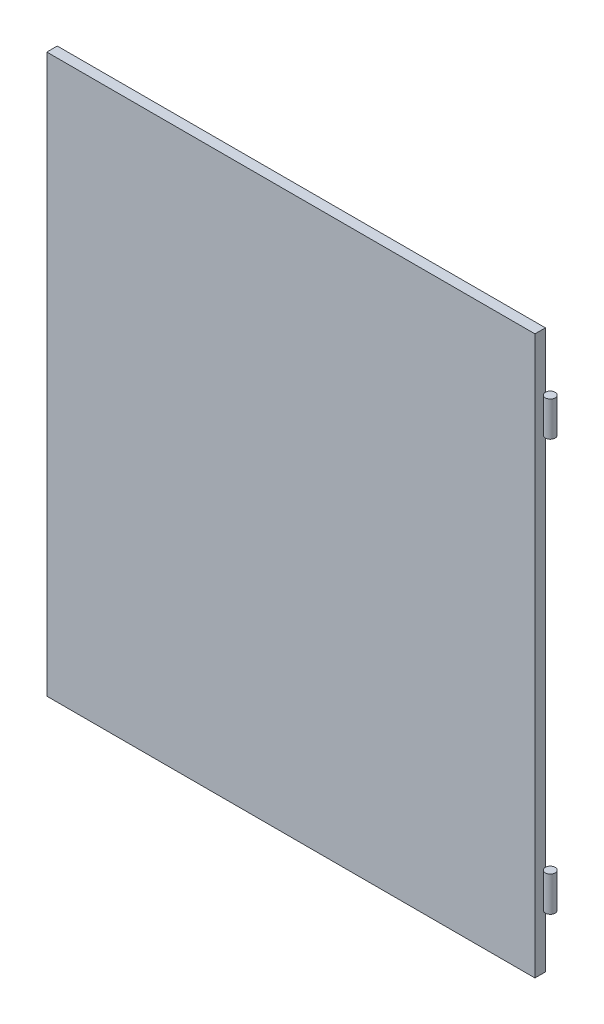
ISO-10303-21;
HEADER;
FILE_DESCRIPTION(('STEP AP214'),'2;1');
FILE_NAME('part.step','',(''),(''),'','','');
FILE_SCHEMA(('AUTOMOTIVE_DESIGN { 1 0 10303 214 1 1 1 1 }'));
ENDSEC;
DATA;
#1=APPLICATION_CONTEXT('core data for automotive mechanical design processes');
#2=APPLICATION_PROTOCOL_DEFINITION('international standard','automotive_design',2000,#1);
#3=PRODUCT_CONTEXT('',#1,'mechanical');
#4=PRODUCT('Part','Part','',(#3));
#5=PRODUCT_RELATED_PRODUCT_CATEGORY('part','',(#4));
#6=PRODUCT_DEFINITION_FORMATION('','',#4);
#7=PRODUCT_DEFINITION_CONTEXT('part definition',#1,'design');
#8=PRODUCT_DEFINITION('design','',#6,#7);
#9=PRODUCT_DEFINITION_SHAPE('','',#8);
#10=(LENGTH_UNIT() NAMED_UNIT(*) SI_UNIT(.MILLI.,.METRE.));
#11=(NAMED_UNIT(*) PLANE_ANGLE_UNIT() SI_UNIT($,.RADIAN.));
#12=(NAMED_UNIT(*) SI_UNIT($,.STERADIAN.) SOLID_ANGLE_UNIT());
#13=UNCERTAINTY_MEASURE_WITH_UNIT(LENGTH_MEASURE(1.E-05),#10,'distance_accuracy_value','');
#14=(GEOMETRIC_REPRESENTATION_CONTEXT(3) GLOBAL_UNCERTAINTY_ASSIGNED_CONTEXT((#13)) GLOBAL_UNIT_ASSIGNED_CONTEXT((#10,
#11,#12)) REPRESENTATION_CONTEXT('',''));
#15=CARTESIAN_POINT('',(0.,0.,0.));
#16=DIRECTION('',(0.,0.,1.));
#17=DIRECTION('',(1.,0.,0.));
#18=AXIS2_PLACEMENT_3D('',#15,#16,#17);
#19=CARTESIAN_POINT('',(707.,-819.798989873223,0.));
#20=DIRECTION('',(0.,1.,0.));
#21=DIRECTION('',(0.,0.,1.));
#22=AXIS2_PLACEMENT_3D('',#19,#20,#21);
#23=CYLINDRICAL_SURFACE('',#22,7.00000000000004);
#24=CARTESIAN_POINT('',(707.,-720.,0.));
#25=DIRECTION('',(0.,1.,0.));
#26=DIRECTION('',(0.,0.,1.));
#27=AXIS2_PLACEMENT_3D('',#24,#25,#26);
#28=CIRCLE('',#27,7.00000000000004);
#29=CARTESIAN_POINT('',(707.,-720.,7.00000000000004));
#30=VERTEX_POINT('',#29);
#31=EDGE_CURVE('E11',#30,#30,#28,.F.);
#32=ORIENTED_EDGE('',*,*,#31,.F.);
#33=EDGE_LOOP('',(#32));
#34=FACE_BOUND('',#33,.T.);
#35=CARTESIAN_POINT('',(707.,-670.,0.));
#36=DIRECTION('',(0.,-1.,0.));
#37=DIRECTION('',(0.,0.,-1.));
#38=AXIS2_PLACEMENT_3D('',#35,#36,#37);
#39=CIRCLE('',#38,7.00000000000004);
#40=CARTESIAN_POINT('',(707.,-670.,-7.00000000000004));
#41=VERTEX_POINT('',#40);
#42=EDGE_CURVE('E43',#41,#41,#39,.F.);
#43=ORIENTED_EDGE('',*,*,#42,.F.);
#44=EDGE_LOOP('',(#43));
#45=FACE_BOUND('',#44,.T.);
#46=ADVANCED_FACE('F40',(#34,#45),#23,.T.);
#47=CARTESIAN_POINT('',(700.,-670.,-10.));
#48=DIRECTION('',(0.,-1.,0.));
#49=DIRECTION('',(0.,0.,-1.));
#50=AXIS2_PLACEMENT_3D('',#47,#48,#49);
#51=PLANE('',#50);
#52=ORIENTED_EDGE('',*,*,#42,.T.);
#53=EDGE_LOOP('',(#52));
#54=FACE_BOUND('',#53,.T.);
#55=ADVANCED_FACE('F52',(#54),#51,.F.);
#56=CARTESIAN_POINT('',(700.,-720.,-10.));
#57=DIRECTION('',(0.,1.,0.));
#58=DIRECTION('',(0.,0.,1.));
#59=AXIS2_PLACEMENT_3D('',#56,#57,#58);
#60=PLANE('',#59);
#61=ORIENTED_EDGE('',*,*,#31,.T.);
#62=EDGE_LOOP('',(#61));
#63=FACE_BOUND('',#62,.T.);
#64=ADVANCED_FACE('F59',(#63),#60,.F.);
#65=CLOSED_SHELL('',(#46,#55,#64));
#66=MANIFOLD_SOLID_BREP('B2',#65);
#67=CARTESIAN_POINT('',(700.,-80.,-10.));
#68=DIRECTION('',(0.,-1.,0.));
#69=DIRECTION('',(0.,0.,-1.));
#70=AXIS2_PLACEMENT_3D('',#67,#68,#69);
#71=PLANE('',#70);
#72=CARTESIAN_POINT('',(707.,-80.,0.));
#73=DIRECTION('',(0.,-1.,0.));
#74=DIRECTION('',(0.,0.,-1.));
#75=AXIS2_PLACEMENT_3D('',#72,#73,#74);
#76=CIRCLE('',#75,7.00000000000004);
#77=CARTESIAN_POINT('',(707.,-80.,-7.00000000000004));
#78=VERTEX_POINT('',#77);
#79=EDGE_CURVE('E39',#78,#78,#76,.F.);
#80=ORIENTED_EDGE('',*,*,#79,.T.);
#81=EDGE_LOOP('',(#80));
#82=FACE_BOUND('',#81,.T.);
#83=ADVANCED_FACE('F90',(#82),#71,.F.);
#84=CARTESIAN_POINT('',(707.,-819.798989873223,0.));
#85=DIRECTION('',(0.,1.,0.));
#86=DIRECTION('',(0.,0.,1.));
#87=AXIS2_PLACEMENT_3D('',#84,#85,#86);
#88=CYLINDRICAL_SURFACE('',#87,7.00000000000004);
#89=CARTESIAN_POINT('',(707.,-130.,0.));
#90=DIRECTION('',(0.,1.,0.));
#91=DIRECTION('',(0.,0.,1.));
#92=AXIS2_PLACEMENT_3D('',#89,#90,#91);
#93=CIRCLE('',#92,7.00000000000004);
#94=CARTESIAN_POINT('',(707.,-130.,7.00000000000004));
#95=VERTEX_POINT('',#94);
#96=EDGE_CURVE('E94',#95,#95,#93,.F.);
#97=ORIENTED_EDGE('',*,*,#96,.F.);
#98=EDGE_LOOP('',(#97));
#99=FACE_BOUND('',#98,.T.);
#100=ORIENTED_EDGE('',*,*,#79,.F.);
#101=EDGE_LOOP('',(#100));
#102=FACE_BOUND('',#101,.T.);
#103=ADVANCED_FACE('F92',(#99,#102),#88,.T.);
#104=CARTESIAN_POINT('',(700.,-130.,-10.));
#105=DIRECTION('',(0.,1.,0.));
#106=DIRECTION('',(0.,0.,1.));
#107=AXIS2_PLACEMENT_3D('',#104,#105,#106);
#108=PLANE('',#107);
#109=ORIENTED_EDGE('',*,*,#96,.T.);
#110=EDGE_LOOP('',(#109));
#111=FACE_BOUND('',#110,.T.);
#112=ADVANCED_FACE('F103',(#111),#108,.F.);
#113=CLOSED_SHELL('',(#83,#103,#112));
#114=MANIFOLD_SOLID_BREP('B6',#113);
#115=CARTESIAN_POINT('',(0.,0.,15.));
#116=DIRECTION('',(1.,0.,0.));
#117=DIRECTION('',(0.,1.,0.));
#118=AXIS2_PLACEMENT_3D('',#115,#116,#117);
#119=PLANE('',#118);
#120=DIRECTION('',(0.,-1.,0.));
#121=VECTOR('',#120,1.);
#122=CARTESIAN_POINT('',(0.,0.,0.));
#123=LINE('',#122,#121);
#124=CARTESIAN_POINT('',(0.,0.,0.));
#125=VERTEX_POINT('',#124);
#126=CARTESIAN_POINT('',(0.,-800.,0.));
#127=VERTEX_POINT('',#126);
#128=EDGE_CURVE('E238',#125,#127,#123,.T.);
#129=ORIENTED_EDGE('',*,*,#128,.T.);
#130=DIRECTION('',(0.,0.,-1.));
#131=VECTOR('',#130,1.);
#132=CARTESIAN_POINT('',(0.,-800.,15.));
#133=LINE('',#132,#131);
#134=CARTESIAN_POINT('',(0.,-800.,15.));
#135=VERTEX_POINT('',#134);
#136=EDGE_CURVE('E88',#135,#127,#133,.T.);
#137=ORIENTED_EDGE('',*,*,#136,.F.);
#138=DIRECTION('',(0.,-1.,0.));
#139=VECTOR('',#138,1.);
#140=CARTESIAN_POINT('',(0.,0.,15.));
#141=LINE('',#140,#139);
#142=CARTESIAN_POINT('',(0.,0.,15.));
#143=VERTEX_POINT('',#142);
#144=EDGE_CURVE('E242',#143,#135,#141,.T.);
#145=ORIENTED_EDGE('',*,*,#144,.F.);
#146=DIRECTION('',(0.,0.,-1.));
#147=VECTOR('',#146,1.);
#148=CARTESIAN_POINT('',(0.,0.,15.));
#149=LINE('',#148,#147);
#150=EDGE_CURVE('E248',#143,#125,#149,.T.);
#151=ORIENTED_EDGE('',*,*,#150,.T.);
#152=EDGE_LOOP('',(#129,#137,#145,#151));
#153=FACE_BOUND('',#152,.T.);
#154=ADVANCED_FACE('F130',(#153),#119,.F.);
#155=CARTESIAN_POINT('',(0.,-800.,15.));
#156=DIRECTION('',(0.,1.,0.));
#157=DIRECTION('',(0.,0.,1.));
#158=AXIS2_PLACEMENT_3D('',#155,#156,#157);
#159=PLANE('',#158);
#160=DIRECTION('',(1.,0.,0.));
#161=VECTOR('',#160,1.);
#162=CARTESIAN_POINT('',(0.,-800.,0.));
#163=LINE('',#162,#161);
#164=CARTESIAN_POINT('',(700.,-800.,0.));
#165=VERTEX_POINT('',#164);
#166=EDGE_CURVE('E251',#127,#165,#163,.T.);
#167=ORIENTED_EDGE('',*,*,#166,.T.);
#168=DIRECTION('',(0.,0.,-1.));
#169=VECTOR('',#168,1.);
#170=CARTESIAN_POINT('',(700.,-800.,15.));
#171=LINE('',#170,#169);
#172=CARTESIAN_POINT('',(700.,-800.,15.));
#173=VERTEX_POINT('',#172);
#174=EDGE_CURVE('E137',#173,#165,#171,.T.);
#175=ORIENTED_EDGE('',*,*,#174,.F.);
#176=DIRECTION('',(1.,0.,0.));
#177=VECTOR('',#176,1.);
#178=CARTESIAN_POINT('',(0.,-800.,15.));
#179=LINE('',#178,#177);
#180=EDGE_CURVE('E181',#135,#173,#179,.T.);
#181=ORIENTED_EDGE('',*,*,#180,.F.);
#182=ORIENTED_EDGE('',*,*,#136,.T.);
#183=EDGE_LOOP('',(#167,#175,#181,#182));
#184=FACE_BOUND('',#183,.T.);
#185=ADVANCED_FACE('F279',(#184),#159,.F.);
#186=CARTESIAN_POINT('',(700.,0.,15.));
#187=DIRECTION('',(-1.,0.,0.));
#188=DIRECTION('',(0.,-1.,0.));
#189=AXIS2_PLACEMENT_3D('',#186,#187,#188);
#190=PLANE('',#189);
#191=DIRECTION('',(0.,1.,0.));
#192=VECTOR('',#191,1.);
#193=CARTESIAN_POINT('',(700.,0.,0.));
#194=LINE('',#193,#192);
#195=CARTESIAN_POINT('',(700.,0.,0.));
#196=VERTEX_POINT('',#195);
#197=EDGE_CURVE('E253',#165,#196,#194,.T.);
#198=ORIENTED_EDGE('',*,*,#197,.T.);
#199=DIRECTION('',(0.,0.,-1.));
#200=VECTOR('',#199,1.);
#201=CARTESIAN_POINT('',(700.,0.,15.));
#202=LINE('',#201,#200);
#203=CARTESIAN_POINT('',(700.,0.,15.));
#204=VERTEX_POINT('',#203);
#205=EDGE_CURVE('E257',#204,#196,#202,.T.);
#206=ORIENTED_EDGE('',*,*,#205,.F.);
#207=DIRECTION('',(0.,1.,0.));
#208=VECTOR('',#207,1.);
#209=CARTESIAN_POINT('',(700.,0.,15.));
#210=LINE('',#209,#208);
#211=EDGE_CURVE('E245',#173,#204,#210,.T.);
#212=ORIENTED_EDGE('',*,*,#211,.F.);
#213=ORIENTED_EDGE('',*,*,#174,.T.);
#214=EDGE_LOOP('',(#198,#206,#212,#213));
#215=FACE_BOUND('',#214,.T.);
#216=ADVANCED_FACE('F262',(#215),#190,.F.);
#217=CARTESIAN_POINT('',(0.,0.,15.));
#218=DIRECTION('',(0.,-1.,0.));
#219=DIRECTION('',(0.,0.,-1.));
#220=AXIS2_PLACEMENT_3D('',#217,#218,#219);
#221=PLANE('',#220);
#222=DIRECTION('',(-1.,0.,0.));
#223=VECTOR('',#222,1.);
#224=CARTESIAN_POINT('',(0.,0.,0.));
#225=LINE('',#224,#223);
#226=EDGE_CURVE('E174',#196,#125,#225,.T.);
#227=ORIENTED_EDGE('',*,*,#226,.T.);
#228=ORIENTED_EDGE('',*,*,#150,.F.);
#229=DIRECTION('',(-1.,0.,0.));
#230=VECTOR('',#229,1.);
#231=CARTESIAN_POINT('',(0.,0.,15.));
#232=LINE('',#231,#230);
#233=EDGE_CURVE('E153',#204,#143,#232,.T.);
#234=ORIENTED_EDGE('',*,*,#233,.F.);
#235=ORIENTED_EDGE('',*,*,#205,.T.);
#236=EDGE_LOOP('',(#227,#228,#234,#235));
#237=FACE_BOUND('',#236,.T.);
#238=ADVANCED_FACE('F270',(#237),#221,.F.);
#239=CARTESIAN_POINT('',(0.,0.,15.));
#240=DIRECTION('',(0.,0.,1.));
#241=DIRECTION('',(1.,0.,0.));
#242=AXIS2_PLACEMENT_3D('',#239,#240,#241);
#243=PLANE('',#242);
#244=ORIENTED_EDGE('',*,*,#144,.T.);
#245=ORIENTED_EDGE('',*,*,#180,.T.);
#246=ORIENTED_EDGE('',*,*,#211,.T.);
#247=ORIENTED_EDGE('',*,*,#233,.T.);
#248=EDGE_LOOP('',(#244,#245,#246,#247));
#249=FACE_BOUND('',#248,.T.);
#250=ADVANCED_FACE('F272',(#249),#243,.T.);
#251=CARTESIAN_POINT('',(0.,0.,0.));
#252=DIRECTION('',(0.,0.,1.));
#253=DIRECTION('',(1.,0.,0.));
#254=AXIS2_PLACEMENT_3D('',#251,#252,#253);
#255=PLANE('',#254);
#256=DIRECTION('',(0.,1.,0.));
#257=VECTOR('',#256,1.);
#258=CARTESIAN_POINT('',(5.0000000000001,-795.,0.));
#259=LINE('',#258,#257);
#260=CARTESIAN_POINT('',(5.0000000000001,-795.,0.));
#261=VERTEX_POINT('',#260);
#262=CARTESIAN_POINT('',(5.,-5.,0.));
#263=VERTEX_POINT('',#262);
#264=EDGE_CURVE('E232',#261,#263,#259,.T.);
#265=ORIENTED_EDGE('',*,*,#264,.F.);
#266=DIRECTION('',(-1.,0.,0.));
#267=VECTOR('',#266,1.);
#268=CARTESIAN_POINT('',(695.,-795.,0.));
#269=LINE('',#268,#267);
#270=CARTESIAN_POINT('',(695.,-795.,0.));
#271=VERTEX_POINT('',#270);
#272=EDGE_CURVE('E144',#271,#261,#269,.T.);
#273=ORIENTED_EDGE('',*,*,#272,.F.);
#274=DIRECTION('',(0.,-1.,0.));
#275=VECTOR('',#274,1.);
#276=CARTESIAN_POINT('',(695.,-5.,0.));
#277=LINE('',#276,#275);
#278=CARTESIAN_POINT('',(695.,-5.,0.));
#279=VERTEX_POINT('',#278);
#280=EDGE_CURVE('E223',#279,#271,#277,.T.);
#281=ORIENTED_EDGE('',*,*,#280,.F.);
#282=DIRECTION('',(1.,0.,0.));
#283=VECTOR('',#282,1.);
#284=CARTESIAN_POINT('',(5.,-5.,0.));
#285=LINE('',#284,#283);
#286=EDGE_CURVE('E226',#263,#279,#285,.T.);
#287=ORIENTED_EDGE('',*,*,#286,.F.);
#288=EDGE_LOOP('',(#265,#273,#281,#287));
#289=FACE_BOUND('',#288,.T.);
#290=ORIENTED_EDGE('',*,*,#128,.F.);
#291=ORIENTED_EDGE('',*,*,#226,.F.);
#292=ORIENTED_EDGE('',*,*,#197,.F.);
#293=ORIENTED_EDGE('',*,*,#166,.F.);
#294=EDGE_LOOP('',(#290,#291,#292,#293));
#295=FACE_BOUND('',#294,.T.);
#296=ADVANCED_FACE('F266',(#289,#295),#255,.F.);
#297=CARTESIAN_POINT('',(695.,-795.,10.));
#298=DIRECTION('',(0.,-1.,0.));
#299=DIRECTION('',(0.,0.,-1.));
#300=AXIS2_PLACEMENT_3D('',#297,#298,#299);
#301=PLANE('',#300);
#302=ORIENTED_EDGE('',*,*,#272,.T.);
#303=DIRECTION('',(0.,0.,-1.));
#304=VECTOR('',#303,1.);
#305=CARTESIAN_POINT('',(5.0000000000001,-795.,10.));
#306=LINE('',#305,#304);
#307=CARTESIAN_POINT('',(5.0000000000001,-795.,10.));
#308=VERTEX_POINT('',#307);
#309=EDGE_CURVE('E201',#308,#261,#306,.T.);
#310=ORIENTED_EDGE('',*,*,#309,.F.);
#311=DIRECTION('',(-1.,0.,0.));
#312=VECTOR('',#311,1.);
#313=CARTESIAN_POINT('',(695.,-795.,10.));
#314=LINE('',#313,#312);
#315=CARTESIAN_POINT('',(695.,-795.,10.));
#316=VERTEX_POINT('',#315);
#317=EDGE_CURVE('E205',#316,#308,#314,.T.);
#318=ORIENTED_EDGE('',*,*,#317,.F.);
#319=DIRECTION('',(0.,0.,-1.));
#320=VECTOR('',#319,1.);
#321=CARTESIAN_POINT('',(695.,-795.,10.));
#322=LINE('',#321,#320);
#323=EDGE_CURVE('E236',#316,#271,#322,.T.);
#324=ORIENTED_EDGE('',*,*,#323,.T.);
#325=EDGE_LOOP('',(#302,#310,#318,#324));
#326=FACE_BOUND('',#325,.T.);
#327=ADVANCED_FACE('F203',(#326),#301,.F.);
#328=CARTESIAN_POINT('',(695.,-5.,10.));
#329=DIRECTION('',(1.,0.,0.));
#330=DIRECTION('',(0.,1.,0.));
#331=AXIS2_PLACEMENT_3D('',#328,#329,#330);
#332=PLANE('',#331);
#333=ORIENTED_EDGE('',*,*,#280,.T.);
#334=ORIENTED_EDGE('',*,*,#323,.F.);
#335=DIRECTION('',(0.,-1.,0.));
#336=VECTOR('',#335,1.);
#337=CARTESIAN_POINT('',(695.,-5.,10.));
#338=LINE('',#337,#336);
#339=CARTESIAN_POINT('',(695.,-5.,10.));
#340=VERTEX_POINT('',#339);
#341=EDGE_CURVE('E211',#340,#316,#338,.T.);
#342=ORIENTED_EDGE('',*,*,#341,.F.);
#343=DIRECTION('',(0.,0.,-1.));
#344=VECTOR('',#343,1.);
#345=CARTESIAN_POINT('',(695.,-5.,10.));
#346=LINE('',#345,#344);
#347=EDGE_CURVE('E239',#340,#279,#346,.T.);
#348=ORIENTED_EDGE('',*,*,#347,.T.);
#349=EDGE_LOOP('',(#333,#334,#342,#348));
#350=FACE_BOUND('',#349,.T.);
#351=ADVANCED_FACE('F319',(#350),#332,.F.);
#352=CARTESIAN_POINT('',(5.,-5.,10.));
#353=DIRECTION('',(0.,1.,0.));
#354=DIRECTION('',(0.,0.,1.));
#355=AXIS2_PLACEMENT_3D('',#352,#353,#354);
#356=PLANE('',#355);
#357=ORIENTED_EDGE('',*,*,#286,.T.);
#358=ORIENTED_EDGE('',*,*,#347,.F.);
#359=DIRECTION('',(1.,0.,0.));
#360=VECTOR('',#359,1.);
#361=CARTESIAN_POINT('',(5.,-5.,10.));
#362=LINE('',#361,#360);
#363=CARTESIAN_POINT('',(5.,-5.,10.));
#364=VERTEX_POINT('',#363);
#365=EDGE_CURVE('E219',#364,#340,#362,.T.);
#366=ORIENTED_EDGE('',*,*,#365,.F.);
#367=DIRECTION('',(0.,0.,-1.));
#368=VECTOR('',#367,1.);
#369=CARTESIAN_POINT('',(5.,-5.,10.));
#370=LINE('',#369,#368);
#371=EDGE_CURVE('E210',#364,#263,#370,.T.);
#372=ORIENTED_EDGE('',*,*,#371,.T.);
#373=EDGE_LOOP('',(#357,#358,#366,#372));
#374=FACE_BOUND('',#373,.T.);
#375=ADVANCED_FACE('F328',(#374),#356,.F.);
#376=CARTESIAN_POINT('',(5.0000000000001,-795.,10.));
#377=DIRECTION('',(-1.,0.,0.));
#378=DIRECTION('',(0.,-1.,0.));
#379=AXIS2_PLACEMENT_3D('',#376,#377,#378);
#380=PLANE('',#379);
#381=ORIENTED_EDGE('',*,*,#264,.T.);
#382=ORIENTED_EDGE('',*,*,#371,.F.);
#383=DIRECTION('',(0.,1.,0.));
#384=VECTOR('',#383,1.);
#385=CARTESIAN_POINT('',(5.0000000000001,-795.,10.));
#386=LINE('',#385,#384);
#387=EDGE_CURVE('E214',#308,#364,#386,.T.);
#388=ORIENTED_EDGE('',*,*,#387,.F.);
#389=ORIENTED_EDGE('',*,*,#309,.T.);
#390=EDGE_LOOP('',(#381,#382,#388,#389));
#391=FACE_BOUND('',#390,.T.);
#392=ADVANCED_FACE('F215',(#391),#380,.F.);
#393=CARTESIAN_POINT('',(0.,0.,10.));
#394=DIRECTION('',(0.,0.,-1.));
#395=DIRECTION('',(-1.,0.,0.));
#396=AXIS2_PLACEMENT_3D('',#393,#394,#395);
#397=PLANE('',#396);
#398=ORIENTED_EDGE('',*,*,#317,.T.);
#399=ORIENTED_EDGE('',*,*,#387,.T.);
#400=ORIENTED_EDGE('',*,*,#365,.T.);
#401=ORIENTED_EDGE('',*,*,#341,.T.);
#402=EDGE_LOOP('',(#398,#399,#400,#401));
#403=FACE_BOUND('',#402,.T.);
#404=ADVANCED_FACE('F221',(#403),#397,.T.);
#405=CLOSED_SHELL('',(#154,#185,#216,#238,#250,#296,#327,#351,#375,#392,#404));
#406=MANIFOLD_SOLID_BREP('B34',#405);
#407=ADVANCED_BREP_SHAPE_REPRESENTATION('',(#18,#66,#114,#406),#14);
#408=SHAPE_DEFINITION_REPRESENTATION(#9,#407);
ENDSEC;
END-ISO-10303-21;
